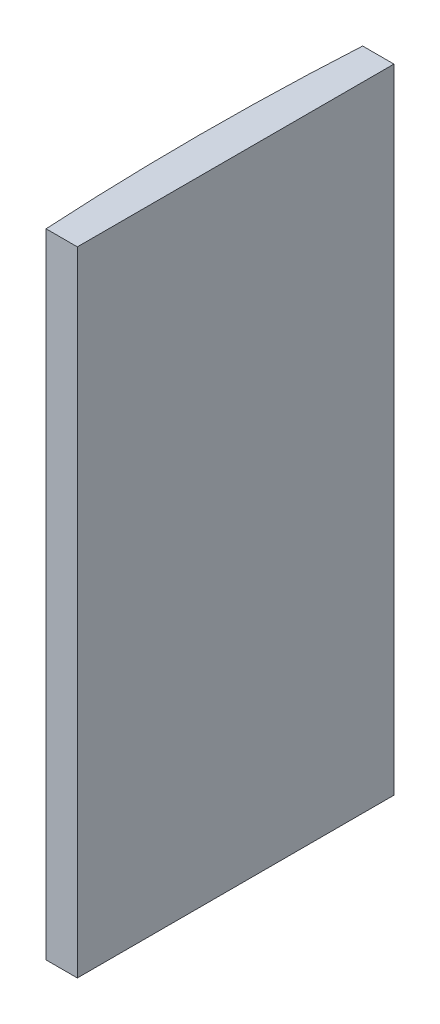
ISO-10303-21;
HEADER;
FILE_DESCRIPTION(('STEP AP214'),'2;1');
FILE_NAME('part.step','',(''),(''),'','','');
FILE_SCHEMA(('AUTOMOTIVE_DESIGN { 1 0 10303 214 1 1 1 1 }'));
ENDSEC;
DATA;
#1=APPLICATION_CONTEXT('core data for automotive mechanical design processes');
#2=APPLICATION_PROTOCOL_DEFINITION('international standard','automotive_design',2000,#1);
#3=PRODUCT_CONTEXT('',#1,'mechanical');
#4=PRODUCT('Part','Part','',(#3));
#5=PRODUCT_RELATED_PRODUCT_CATEGORY('part','',(#4));
#6=PRODUCT_DEFINITION_FORMATION('','',#4);
#7=PRODUCT_DEFINITION_CONTEXT('part definition',#1,'design');
#8=PRODUCT_DEFINITION('design','',#6,#7);
#9=PRODUCT_DEFINITION_SHAPE('','',#8);
#10=(LENGTH_UNIT() NAMED_UNIT(*) SI_UNIT(.MILLI.,.METRE.));
#11=(NAMED_UNIT(*) PLANE_ANGLE_UNIT() SI_UNIT($,.RADIAN.));
#12=(NAMED_UNIT(*) SI_UNIT($,.STERADIAN.) SOLID_ANGLE_UNIT());
#13=UNCERTAINTY_MEASURE_WITH_UNIT(LENGTH_MEASURE(1.E-05),#10,'distance_accuracy_value','');
#14=(GEOMETRIC_REPRESENTATION_CONTEXT(3) GLOBAL_UNCERTAINTY_ASSIGNED_CONTEXT((#13)) GLOBAL_UNIT_ASSIGNED_CONTEXT((#10,
#11,#12)) REPRESENTATION_CONTEXT('',''));
#15=CARTESIAN_POINT('',(0.,0.,0.));
#16=DIRECTION('',(0.,0.,1.));
#17=DIRECTION('',(1.,0.,0.));
#18=AXIS2_PLACEMENT_3D('',#15,#16,#17);
#19=CARTESIAN_POINT('',(4.35520433485127,60.,0.));
#20=DIRECTION('',(0.,-1.,0.));
#21=DIRECTION('',(0.,0.,-1.));
#22=AXIS2_PLACEMENT_3D('',#19,#20,#21);
#23=CYLINDRICAL_SURFACE('',#22,258.5);
#24=CARTESIAN_POINT('',(4.35520433485127,0.,0.));
#25=DIRECTION('',(0.,1.,0.));
#26=DIRECTION('',(0.,0.,1.));
#27=AXIS2_PLACEMENT_3D('',#24,#25,#26);
#28=CIRCLE('',#27,258.5);
#29=CARTESIAN_POINT('',(-253.70922560465,0.,-15.));
#30=VERTEX_POINT('',#29);
#31=CARTESIAN_POINT('',(-253.70922560465,0.,15.));
#32=VERTEX_POINT('',#31);
#33=EDGE_CURVE('E100',#30,#32,#28,.T.);
#34=ORIENTED_EDGE('',*,*,#33,.T.);
#35=DIRECTION('',(0.,-1.,0.));
#36=VECTOR('',#35,1.);
#37=CARTESIAN_POINT('',(-253.70922560465,60.,15.));
#38=LINE('',#37,#36);
#39=CARTESIAN_POINT('',(-253.70922560465,60.,15.));
#40=VERTEX_POINT('',#39);
#41=EDGE_CURVE('E11',#40,#32,#38,.T.);
#42=ORIENTED_EDGE('',*,*,#41,.F.);
#43=CARTESIAN_POINT('',(4.35520433485127,60.,0.));
#44=DIRECTION('',(0.,1.,0.));
#45=DIRECTION('',(0.,0.,1.));
#46=AXIS2_PLACEMENT_3D('',#43,#44,#45);
#47=CIRCLE('',#46,258.5);
#48=CARTESIAN_POINT('',(-253.70922560465,60.,-15.));
#49=VERTEX_POINT('',#48);
#50=EDGE_CURVE('E88',#49,#40,#47,.T.);
#51=ORIENTED_EDGE('',*,*,#50,.F.);
#52=DIRECTION('',(0.,-1.,0.));
#53=VECTOR('',#52,1.);
#54=CARTESIAN_POINT('',(-253.70922560465,60.,-15.));
#55=LINE('',#54,#53);
#56=EDGE_CURVE('E96',#49,#30,#55,.T.);
#57=ORIENTED_EDGE('',*,*,#56,.T.);
#58=EDGE_LOOP('',(#34,#42,#51,#57));
#59=FACE_BOUND('',#58,.T.);
#60=ADVANCED_FACE('F37',(#59),#23,.T.);
#61=CARTESIAN_POINT('',(-253.70922560465,60.,15.));
#62=DIRECTION('',(0.,0.,-1.));
#63=DIRECTION('',(-1.,0.,0.));
#64=AXIS2_PLACEMENT_3D('',#61,#62,#63);
#65=PLANE('',#64);
#66=DIRECTION('',(1.,0.,0.));
#67=VECTOR('',#66,1.);
#68=CARTESIAN_POINT('',(-253.70922560465,0.,15.));
#69=LINE('',#68,#67);
#70=CARTESIAN_POINT('',(-250.744795665149,0.,15.));
#71=VERTEX_POINT('',#70);
#72=EDGE_CURVE('E92',#32,#71,#69,.T.);
#73=ORIENTED_EDGE('',*,*,#72,.T.);
#74=DIRECTION('',(0.,-1.,0.));
#75=VECTOR('',#74,1.);
#76=CARTESIAN_POINT('',(-250.744795665149,60.,15.));
#77=LINE('',#76,#75);
#78=CARTESIAN_POINT('',(-250.744795665149,60.,15.));
#79=VERTEX_POINT('',#78);
#80=EDGE_CURVE('E45',#79,#71,#77,.T.);
#81=ORIENTED_EDGE('',*,*,#80,.F.);
#82=DIRECTION('',(1.,0.,0.));
#83=VECTOR('',#82,1.);
#84=CARTESIAN_POINT('',(-253.70922560465,60.,15.));
#85=LINE('',#84,#83);
#86=EDGE_CURVE('E83',#40,#79,#85,.T.);
#87=ORIENTED_EDGE('',*,*,#86,.F.);
#88=ORIENTED_EDGE('',*,*,#41,.T.);
#89=EDGE_LOOP('',(#73,#81,#87,#88));
#90=FACE_BOUND('',#89,.T.);
#91=ADVANCED_FACE('F91',(#90),#65,.F.);
#92=CARTESIAN_POINT('',(-250.744795665149,60.,-15.));
#93=DIRECTION('',(-1.,0.,0.));
#94=DIRECTION('',(0.,0.,1.));
#95=AXIS2_PLACEMENT_3D('',#92,#93,#94);
#96=PLANE('',#95);
#97=DIRECTION('',(0.,0.,-1.));
#98=VECTOR('',#97,1.);
#99=CARTESIAN_POINT('',(-250.744795665149,0.,-15.));
#100=LINE('',#99,#98);
#101=CARTESIAN_POINT('',(-250.744795665149,0.,-15.));
#102=VERTEX_POINT('',#101);
#103=EDGE_CURVE('E70',#71,#102,#100,.T.);
#104=ORIENTED_EDGE('',*,*,#103,.T.);
#105=DIRECTION('',(0.,-1.,0.));
#106=VECTOR('',#105,1.);
#107=CARTESIAN_POINT('',(-250.744795665149,60.,-15.));
#108=LINE('',#107,#106);
#109=CARTESIAN_POINT('',(-250.744795665149,60.,-15.));
#110=VERTEX_POINT('',#109);
#111=EDGE_CURVE('E93',#110,#102,#108,.T.);
#112=ORIENTED_EDGE('',*,*,#111,.F.);
#113=DIRECTION('',(0.,0.,-1.));
#114=VECTOR('',#113,1.);
#115=CARTESIAN_POINT('',(-250.744795665149,60.,-15.));
#116=LINE('',#115,#114);
#117=EDGE_CURVE('E86',#79,#110,#116,.T.);
#118=ORIENTED_EDGE('',*,*,#117,.F.);
#119=ORIENTED_EDGE('',*,*,#80,.T.);
#120=EDGE_LOOP('',(#104,#112,#118,#119));
#121=FACE_BOUND('',#120,.T.);
#122=ADVANCED_FACE('F94',(#121),#96,.F.);
#123=CARTESIAN_POINT('',(-253.70922560465,60.,-15.));
#124=DIRECTION('',(0.,0.,1.));
#125=DIRECTION('',(1.,0.,0.));
#126=AXIS2_PLACEMENT_3D('',#123,#124,#125);
#127=PLANE('',#126);
#128=DIRECTION('',(-1.,0.,0.));
#129=VECTOR('',#128,1.);
#130=CARTESIAN_POINT('',(-253.70922560465,0.,-15.));
#131=LINE('',#130,#129);
#132=EDGE_CURVE('E76',#102,#30,#131,.T.);
#133=ORIENTED_EDGE('',*,*,#132,.T.);
#134=ORIENTED_EDGE('',*,*,#56,.F.);
#135=DIRECTION('',(-1.,0.,0.));
#136=VECTOR('',#135,1.);
#137=CARTESIAN_POINT('',(-253.70922560465,60.,-15.));
#138=LINE('',#137,#136);
#139=EDGE_CURVE('E53',#110,#49,#138,.T.);
#140=ORIENTED_EDGE('',*,*,#139,.F.);
#141=ORIENTED_EDGE('',*,*,#111,.T.);
#142=EDGE_LOOP('',(#133,#134,#140,#141));
#143=FACE_BOUND('',#142,.T.);
#144=ADVANCED_FACE('F107',(#143),#127,.F.);
#145=CARTESIAN_POINT('',(4.35520433485127,60.,0.));
#146=DIRECTION('',(0.,1.,0.));
#147=DIRECTION('',(0.,0.,1.));
#148=AXIS2_PLACEMENT_3D('',#145,#146,#147);
#149=PLANE('',#148);
#150=ORIENTED_EDGE('',*,*,#50,.T.);
#151=ORIENTED_EDGE('',*,*,#86,.T.);
#152=ORIENTED_EDGE('',*,*,#117,.T.);
#153=ORIENTED_EDGE('',*,*,#139,.T.);
#154=EDGE_LOOP('',(#150,#151,#152,#153));
#155=FACE_BOUND('',#154,.T.);
#156=ADVANCED_FACE('F84',(#155),#149,.T.);
#157=CARTESIAN_POINT('',(4.35520433485127,0.,0.));
#158=DIRECTION('',(0.,1.,0.));
#159=DIRECTION('',(0.,0.,1.));
#160=AXIS2_PLACEMENT_3D('',#157,#158,#159);
#161=PLANE('',#160);
#162=ORIENTED_EDGE('',*,*,#33,.F.);
#163=ORIENTED_EDGE('',*,*,#132,.F.);
#164=ORIENTED_EDGE('',*,*,#103,.F.);
#165=ORIENTED_EDGE('',*,*,#72,.F.);
#166=EDGE_LOOP('',(#162,#163,#164,#165));
#167=FACE_BOUND('',#166,.T.);
#168=ADVANCED_FACE('F110',(#167),#161,.F.);
#169=CLOSED_SHELL('',(#60,#91,#122,#144,#156,#168));
#170=MANIFOLD_SOLID_BREP('B2',#169);
#171=ADVANCED_BREP_SHAPE_REPRESENTATION('',(#18,#170),#14);
#172=SHAPE_DEFINITION_REPRESENTATION(#9,#171);
ENDSEC;
END-ISO-10303-21;
